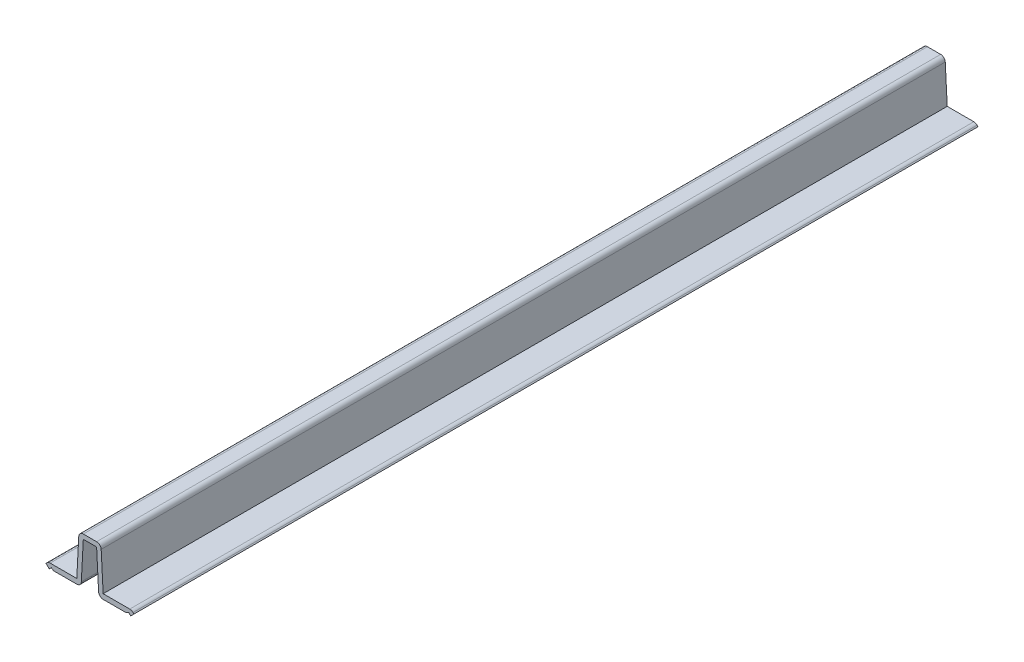
ISO-10303-21;
HEADER;
FILE_DESCRIPTION(('STEP AP214'),'2;1');
FILE_NAME('part.step','',(''),(''),'','','');
FILE_SCHEMA(('AUTOMOTIVE_DESIGN { 1 0 10303 214 1 1 1 1 }'));
ENDSEC;
DATA;
#1=APPLICATION_CONTEXT('core data for automotive mechanical design processes');
#2=APPLICATION_PROTOCOL_DEFINITION('international standard','automotive_design',2000,#1);
#3=PRODUCT_CONTEXT('',#1,'mechanical');
#4=PRODUCT('Part','Part','',(#3));
#5=PRODUCT_RELATED_PRODUCT_CATEGORY('part','',(#4));
#6=PRODUCT_DEFINITION_FORMATION('','',#4);
#7=PRODUCT_DEFINITION_CONTEXT('part definition',#1,'design');
#8=PRODUCT_DEFINITION('design','',#6,#7);
#9=PRODUCT_DEFINITION_SHAPE('','',#8);
#10=(LENGTH_UNIT() NAMED_UNIT(*) SI_UNIT(.MILLI.,.METRE.));
#11=(NAMED_UNIT(*) PLANE_ANGLE_UNIT() SI_UNIT($,.RADIAN.));
#12=(NAMED_UNIT(*) SI_UNIT($,.STERADIAN.) SOLID_ANGLE_UNIT());
#13=UNCERTAINTY_MEASURE_WITH_UNIT(LENGTH_MEASURE(1.E-05),#10,'distance_accuracy_value','');
#14=(GEOMETRIC_REPRESENTATION_CONTEXT(3) GLOBAL_UNCERTAINTY_ASSIGNED_CONTEXT((#13)) GLOBAL_UNIT_ASSIGNED_CONTEXT((#10,
#11,#12)) REPRESENTATION_CONTEXT('',''));
#15=CARTESIAN_POINT('',(0.,0.,0.));
#16=DIRECTION('',(0.,0.,1.));
#17=DIRECTION('',(1.,0.,0.));
#18=AXIS2_PLACEMENT_3D('',#15,#16,#17);
#19=CARTESIAN_POINT('',(-15.0600887340313,1.984375,-304.8));
#20=DIRECTION('',(-0.710174584155781,0.704025610343235,0.));
#21=DIRECTION('',(-0.704025610343235,-0.710174584155781,0.));
#22=AXIS2_PLACEMENT_3D('',#19,#20,#21);
#23=PLANE('',#22);
#24=DIRECTION('',(-0.704025610343235,-0.710174584155781,0.));
#25=VECTOR('',#24,1.);
#26=CARTESIAN_POINT('',(-15.0600887340313,1.984375,0.));
#27=LINE('',#26,#25);
#28=CARTESIAN_POINT('',(-15.5445114932518,1.49572128267668,0.));
#29=VERTEX_POINT('',#28);
#30=CARTESIAN_POINT('',(-15.875,1.16234628267668,0.));
#31=VERTEX_POINT('',#30);
#32=EDGE_CURVE('E265',#29,#31,#27,.T.);
#33=ORIENTED_EDGE('',*,*,#32,.F.);
#34=DIRECTION('',(0.,0.,1.));
#35=VECTOR('',#34,1.);
#36=CARTESIAN_POINT('',(-15.5445114932518,1.49572128267668,-304.8));
#37=LINE('',#36,#35);
#38=CARTESIAN_POINT('',(-15.5445114932518,1.49572128267668,-304.8));
#39=VERTEX_POINT('',#38);
#40=EDGE_CURVE('E204',#29,#39,#37,.F.);
#41=ORIENTED_EDGE('',*,*,#40,.T.);
#42=DIRECTION('',(-0.704025610343235,-0.710174584155781,0.));
#43=VECTOR('',#42,1.);
#44=CARTESIAN_POINT('',(-15.0600887340313,1.984375,-304.8));
#45=LINE('',#44,#43);
#46=CARTESIAN_POINT('',(-15.875,1.16234628267668,-304.8));
#47=VERTEX_POINT('',#46);
#48=EDGE_CURVE('E198',#39,#47,#45,.T.);
#49=ORIENTED_EDGE('',*,*,#48,.T.);
#50=DIRECTION('',(0.,0.,1.));
#51=VECTOR('',#50,1.);
#52=CARTESIAN_POINT('',(-15.875,1.16234628267668,-304.8));
#53=LINE('',#52,#51);
#54=EDGE_CURVE('E201',#47,#31,#53,.T.);
#55=ORIENTED_EDGE('',*,*,#54,.T.);
#56=EDGE_LOOP('',(#33,#41,#49,#55));
#57=FACE_BOUND('',#56,.T.);
#58=ADVANCED_FACE('F35',(#57),#23,.T.);
#59=CARTESIAN_POINT('',(-4.7625,1.984375,-304.8));
#60=DIRECTION('',(0.,1.,0.));
#61=DIRECTION('',(-1.,0.,0.));
#62=AXIS2_PLACEMENT_3D('',#59,#60,#61);
#63=PLANE('',#62);
#64=DIRECTION('',(-1.,0.,0.));
#65=VECTOR('',#64,1.);
#66=CARTESIAN_POINT('',(-4.7625,1.984375,-304.8));
#67=LINE('',#66,#65);
#68=CARTESIAN_POINT('',(-4.7625,1.984375,-304.8));
#69=VERTEX_POINT('',#68);
#70=CARTESIAN_POINT('',(-14.3720132548106,1.984375,-304.8));
#71=VERTEX_POINT('',#70);
#72=EDGE_CURVE('E216',#69,#71,#67,.T.);
#73=ORIENTED_EDGE('',*,*,#72,.T.);
#74=DIRECTION('',(0.,0.,1.));
#75=VECTOR('',#74,1.);
#76=CARTESIAN_POINT('',(-14.3720132548106,1.984375,-304.8));
#77=LINE('',#76,#75);
#78=CARTESIAN_POINT('',(-14.3720132548106,1.984375,0.));
#79=VERTEX_POINT('',#78);
#80=EDGE_CURVE('E364',#71,#79,#77,.T.);
#81=ORIENTED_EDGE('',*,*,#80,.T.);
#82=DIRECTION('',(-1.,0.,0.));
#83=VECTOR('',#82,1.);
#84=CARTESIAN_POINT('',(-4.7625,1.984375,0.));
#85=LINE('',#84,#83);
#86=CARTESIAN_POINT('',(-4.7625,1.984375,0.));
#87=VERTEX_POINT('',#86);
#88=EDGE_CURVE('E208',#87,#79,#85,.T.);
#89=ORIENTED_EDGE('',*,*,#88,.F.);
#90=DIRECTION('',(0.,0.,1.));
#91=VECTOR('',#90,1.);
#92=CARTESIAN_POINT('',(-4.7625,1.984375,-304.8));
#93=LINE('',#92,#91);
#94=EDGE_CURVE('E311',#69,#87,#93,.T.);
#95=ORIENTED_EDGE('',*,*,#94,.F.);
#96=EDGE_LOOP('',(#73,#81,#89,#95));
#97=FACE_BOUND('',#96,.T.);
#98=ADVANCED_FACE('F466',(#97),#63,.T.);
#99=CARTESIAN_POINT('',(-4.7625,1.984375,-304.8));
#100=DIRECTION('',(-0.99861782933251,0.0525588331227637,0.));
#101=DIRECTION('',(-0.0525588331227637,-0.99861782933251,0.));
#102=AXIS2_PLACEMENT_3D('',#99,#100,#101);
#103=PLANE('',#102);
#104=DIRECTION('',(-0.0525588331227637,-0.99861782933251,0.));
#105=VECTOR('',#104,1.);
#106=CARTESIAN_POINT('',(-4.7625,1.984375,0.));
#107=LINE('',#106,#105);
#108=CARTESIAN_POINT('',(-4.05107765086917,15.5013996334857,0.));
#109=VERTEX_POINT('',#108);
#110=EDGE_CURVE('E307',#109,#87,#107,.T.);
#111=ORIENTED_EDGE('',*,*,#110,.F.);
#112=DIRECTION('',(0.,0.,1.));
#113=VECTOR('',#112,1.);
#114=CARTESIAN_POINT('',(-4.05107765086917,15.5013996334857,-304.8));
#115=LINE('',#114,#113);
#116=CARTESIAN_POINT('',(-4.05107765086917,15.5013996334857,-304.8));
#117=VERTEX_POINT('',#116);
#118=EDGE_CURVE('E43',#109,#117,#115,.F.);
#119=ORIENTED_EDGE('',*,*,#118,.T.);
#120=DIRECTION('',(-0.0525588331227637,-0.99861782933251,0.));
#121=VECTOR('',#120,1.);
#122=CARTESIAN_POINT('',(-4.7625,1.984375,-304.8));
#123=LINE('',#122,#121);
#124=EDGE_CURVE('E261',#117,#69,#123,.T.);
#125=ORIENTED_EDGE('',*,*,#124,.T.);
#126=ORIENTED_EDGE('',*,*,#94,.T.);
#127=EDGE_LOOP('',(#111,#119,#125,#126));
#128=FACE_BOUND('',#127,.T.);
#129=ADVANCED_FACE('F385',(#128),#103,.T.);
#130=CARTESIAN_POINT('',(-3.96875,17.065625,-304.8));
#131=DIRECTION('',(0.,1.,0.));
#132=DIRECTION('',(0.,0.,1.));
#133=AXIS2_PLACEMENT_3D('',#130,#131,#132);
#134=PLANE('',#133);
#135=DIRECTION('',(-1.,0.,0.));
#136=VECTOR('',#135,1.);
#137=CARTESIAN_POINT('',(3.96875,17.065625,-304.8));
#138=LINE('',#137,#136);
#139=CARTESIAN_POINT('',(2.4023596146412,17.065625,-304.8));
#140=VERTEX_POINT('',#139);
#141=CARTESIAN_POINT('',(-2.4023596146412,17.065625,-304.8));
#142=VERTEX_POINT('',#141);
#143=EDGE_CURVE('E258',#140,#142,#138,.T.);
#144=ORIENTED_EDGE('',*,*,#143,.T.);
#145=DIRECTION('',(0.,0.,1.));
#146=VECTOR('',#145,1.);
#147=CARTESIAN_POINT('',(-2.4023596146412,17.065625,-304.8));
#148=LINE('',#147,#146);
#149=CARTESIAN_POINT('',(-2.4023596146412,17.065625,0.));
#150=VERTEX_POINT('',#149);
#151=EDGE_CURVE('E379',#142,#150,#148,.T.);
#152=ORIENTED_EDGE('',*,*,#151,.T.);
#153=DIRECTION('',(-1.,0.,0.));
#154=VECTOR('',#153,1.);
#155=CARTESIAN_POINT('',(-3.96875,17.065625,0.));
#156=LINE('',#155,#154);
#157=CARTESIAN_POINT('',(2.4023596146412,17.065625,0.));
#158=VERTEX_POINT('',#157);
#159=EDGE_CURVE('E304',#158,#150,#156,.T.);
#160=ORIENTED_EDGE('',*,*,#159,.F.);
#161=DIRECTION('',(0.,0.,1.));
#162=VECTOR('',#161,1.);
#163=CARTESIAN_POINT('',(2.4023596146412,17.065625,-304.8));
#164=LINE('',#163,#162);
#165=EDGE_CURVE('E377',#158,#140,#164,.F.);
#166=ORIENTED_EDGE('',*,*,#165,.T.);
#167=EDGE_LOOP('',(#144,#152,#160,#166));
#168=FACE_BOUND('',#167,.T.);
#169=ADVANCED_FACE('F395',(#168),#134,.T.);
#170=CARTESIAN_POINT('',(4.7625,1.984375,-304.8));
#171=DIRECTION('',(0.99861782933251,0.0525588331227637,0.));
#172=DIRECTION('',(-0.0525588331227637,0.99861782933251,0.));
#173=AXIS2_PLACEMENT_3D('',#170,#171,#172);
#174=PLANE('',#173);
#175=DIRECTION('',(-0.0525588331227637,0.99861782933251,0.));
#176=VECTOR('',#175,1.);
#177=CARTESIAN_POINT('',(4.7625,1.984375,-304.8));
#178=LINE('',#177,#176);
#179=CARTESIAN_POINT('',(4.7625,1.984375,-304.8));
#180=VERTEX_POINT('',#179);
#181=CARTESIAN_POINT('',(4.05107765086917,15.5013996334857,-304.8));
#182=VERTEX_POINT('',#181);
#183=EDGE_CURVE('E255',#180,#182,#178,.T.);
#184=ORIENTED_EDGE('',*,*,#183,.T.);
#185=DIRECTION('',(0.,0.,1.));
#186=VECTOR('',#185,1.);
#187=CARTESIAN_POINT('',(4.05107765086917,15.5013996334857,-304.8));
#188=LINE('',#187,#186);
#189=CARTESIAN_POINT('',(4.05107765086917,15.5013996334857,0.));
#190=VERTEX_POINT('',#189);
#191=EDGE_CURVE('E11',#182,#190,#188,.T.);
#192=ORIENTED_EDGE('',*,*,#191,.T.);
#193=DIRECTION('',(-0.0525588331227637,0.99861782933251,0.));
#194=VECTOR('',#193,1.);
#195=CARTESIAN_POINT('',(4.7625,1.984375,0.));
#196=LINE('',#195,#194);
#197=CARTESIAN_POINT('',(4.7625,1.984375,0.));
#198=VERTEX_POINT('',#197);
#199=EDGE_CURVE('E301',#198,#190,#196,.T.);
#200=ORIENTED_EDGE('',*,*,#199,.F.);
#201=DIRECTION('',(0.,0.,1.));
#202=VECTOR('',#201,1.);
#203=CARTESIAN_POINT('',(4.7625,1.984375,-304.8));
#204=LINE('',#203,#202);
#205=EDGE_CURVE('E315',#180,#198,#204,.T.);
#206=ORIENTED_EDGE('',*,*,#205,.F.);
#207=EDGE_LOOP('',(#184,#192,#200,#206));
#208=FACE_BOUND('',#207,.T.);
#209=ADVANCED_FACE('F404',(#208),#174,.T.);
#210=CARTESIAN_POINT('',(4.7625,1.984375,-304.8));
#211=DIRECTION('',(0.,1.,0.));
#212=DIRECTION('',(-1.,0.,0.));
#213=AXIS2_PLACEMENT_3D('',#210,#211,#212);
#214=PLANE('',#213);
#215=DIRECTION('',(-1.,0.,0.));
#216=VECTOR('',#215,1.);
#217=CARTESIAN_POINT('',(4.7625,1.984375,0.));
#218=LINE('',#217,#216);
#219=CARTESIAN_POINT('',(14.3720132548106,1.984375,0.));
#220=VERTEX_POINT('',#219);
#221=EDGE_CURVE('E299',#220,#198,#218,.T.);
#222=ORIENTED_EDGE('',*,*,#221,.F.);
#223=DIRECTION('',(0.,0.,1.));
#224=VECTOR('',#223,1.);
#225=CARTESIAN_POINT('',(14.3720132548106,1.984375,-304.8));
#226=LINE('',#225,#224);
#227=CARTESIAN_POINT('',(14.3720132548106,1.984375,-304.8));
#228=VERTEX_POINT('',#227);
#229=EDGE_CURVE('E351',#220,#228,#226,.F.);
#230=ORIENTED_EDGE('',*,*,#229,.T.);
#231=DIRECTION('',(-1.,0.,0.));
#232=VECTOR('',#231,1.);
#233=CARTESIAN_POINT('',(4.7625,1.984375,-304.8));
#234=LINE('',#233,#232);
#235=EDGE_CURVE('E253',#228,#180,#234,.T.);
#236=ORIENTED_EDGE('',*,*,#235,.T.);
#237=ORIENTED_EDGE('',*,*,#205,.T.);
#238=EDGE_LOOP('',(#222,#230,#236,#237));
#239=FACE_BOUND('',#238,.T.);
#240=ADVANCED_FACE('F483',(#239),#214,.T.);
#241=CARTESIAN_POINT('',(15.0600887340313,1.984375,-304.8));
#242=DIRECTION('',(0.710174584155781,0.704025610343235,0.));
#243=DIRECTION('',(-0.704025610343235,0.710174584155781,0.));
#244=AXIS2_PLACEMENT_3D('',#241,#242,#243);
#245=PLANE('',#244);
#246=DIRECTION('',(-0.704025610343235,0.710174584155781,0.));
#247=VECTOR('',#246,1.);
#248=CARTESIAN_POINT('',(15.0600887340313,1.984375,-304.8));
#249=LINE('',#248,#247);
#250=CARTESIAN_POINT('',(15.875,1.16234628267668,-304.8));
#251=VERTEX_POINT('',#250);
#252=CARTESIAN_POINT('',(15.5445114932518,1.49572128267668,-304.8));
#253=VERTEX_POINT('',#252);
#254=EDGE_CURVE('E250',#251,#253,#249,.T.);
#255=ORIENTED_EDGE('',*,*,#254,.T.);
#256=DIRECTION('',(0.,0.,1.));
#257=VECTOR('',#256,1.);
#258=CARTESIAN_POINT('',(15.5445114932518,1.49572128267668,-304.8));
#259=LINE('',#258,#257);
#260=CARTESIAN_POINT('',(15.5445114932518,1.49572128267668,0.));
#261=VERTEX_POINT('',#260);
#262=EDGE_CURVE('E314',#253,#261,#259,.T.);
#263=ORIENTED_EDGE('',*,*,#262,.T.);
#264=DIRECTION('',(-0.704025610343235,0.710174584155781,0.));
#265=VECTOR('',#264,1.);
#266=CARTESIAN_POINT('',(15.0600887340313,1.984375,0.));
#267=LINE('',#266,#265);
#268=CARTESIAN_POINT('',(15.875,1.16234628267668,0.));
#269=VERTEX_POINT('',#268);
#270=EDGE_CURVE('E296',#269,#261,#267,.T.);
#271=ORIENTED_EDGE('',*,*,#270,.F.);
#272=DIRECTION('',(0.,0.,1.));
#273=VECTOR('',#272,1.);
#274=CARTESIAN_POINT('',(15.875,1.16234628267668,-304.8));
#275=LINE('',#274,#273);
#276=EDGE_CURVE('E318',#251,#269,#275,.T.);
#277=ORIENTED_EDGE('',*,*,#276,.F.);
#278=EDGE_LOOP('',(#255,#263,#271,#277));
#279=FACE_BOUND('',#278,.T.);
#280=ADVANCED_FACE('F416',(#279),#245,.T.);
#281=CARTESIAN_POINT('',(15.875,1.16234628267668,-304.8));
#282=DIRECTION('',(0.704025610343234,-0.710174584155781,0.));
#283=DIRECTION('',(0.710174584155781,0.704025610343234,0.));
#284=AXIS2_PLACEMENT_3D('',#281,#282,#283);
#285=PLANE('',#284);
#286=DIRECTION('',(0.710174584155781,0.704025610343234,0.));
#287=VECTOR('',#286,1.);
#288=CARTESIAN_POINT('',(15.875,1.16234628267668,0.));
#289=LINE('',#288,#287);
#290=CARTESIAN_POINT('',(14.7025017615588,0.,0.));
#291=VERTEX_POINT('',#290);
#292=EDGE_CURVE('E293',#291,#269,#289,.T.);
#293=ORIENTED_EDGE('',*,*,#292,.F.);
#294=DIRECTION('',(0.,0.,1.));
#295=VECTOR('',#294,1.);
#296=CARTESIAN_POINT('',(14.7025017615588,0.,-304.8));
#297=LINE('',#296,#295);
#298=CARTESIAN_POINT('',(14.7025017615588,0.,-304.8));
#299=VERTEX_POINT('',#298);
#300=EDGE_CURVE('E320',#299,#291,#297,.T.);
#301=ORIENTED_EDGE('',*,*,#300,.F.);
#302=DIRECTION('',(0.710174584155781,0.704025610343234,0.));
#303=VECTOR('',#302,1.);
#304=CARTESIAN_POINT('',(15.875,1.16234628267668,-304.8));
#305=LINE('',#304,#303);
#306=EDGE_CURVE('E247',#299,#251,#305,.T.);
#307=ORIENTED_EDGE('',*,*,#306,.T.);
#308=ORIENTED_EDGE('',*,*,#276,.T.);
#309=EDGE_LOOP('',(#293,#301,#307,#308));
#310=FACE_BOUND('',#309,.T.);
#311=ADVANCED_FACE('F421',(#310),#285,.T.);
#312=CARTESIAN_POINT('',(14.7025017615588,0.,-304.8));
#313=DIRECTION('',(-0.710174584155781,-0.704025610343234,0.));
#314=DIRECTION('',(0.704025610343234,-0.710174584155781,0.));
#315=AXIS2_PLACEMENT_3D('',#312,#313,#314);
#316=PLANE('',#315);
#317=DIRECTION('',(0.704025610343234,-0.710174584155781,0.));
#318=VECTOR('',#317,1.);
#319=CARTESIAN_POINT('',(14.7025017615588,0.,0.));
#320=LINE('',#319,#318);
#321=CARTESIAN_POINT('',(13.9544315539956,0.754603867771928,0.));
#322=VERTEX_POINT('',#321);
#323=EDGE_CURVE('E290',#322,#291,#320,.T.);
#324=ORIENTED_EDGE('',*,*,#323,.F.);
#325=DIRECTION('',(0.,0.,1.));
#326=VECTOR('',#325,1.);
#327=CARTESIAN_POINT('',(13.9544315539956,0.754603867771928,-304.8));
#328=LINE('',#327,#326);
#329=CARTESIAN_POINT('',(13.9544315539956,0.754603867771928,-304.8));
#330=VERTEX_POINT('',#329);
#331=EDGE_CURVE('E322',#330,#322,#328,.T.);
#332=ORIENTED_EDGE('',*,*,#331,.F.);
#333=DIRECTION('',(0.704025610343234,-0.710174584155781,0.));
#334=VECTOR('',#333,1.);
#335=CARTESIAN_POINT('',(14.7025017615588,0.,-304.8));
#336=LINE('',#335,#334);
#337=EDGE_CURVE('E244',#330,#299,#336,.T.);
#338=ORIENTED_EDGE('',*,*,#337,.T.);
#339=ORIENTED_EDGE('',*,*,#300,.T.);
#340=EDGE_LOOP('',(#324,#332,#338,#339));
#341=FACE_BOUND('',#340,.T.);
#342=ADVANCED_FACE('F426',(#341),#316,.T.);
#343=CARTESIAN_POINT('',(13.9544315539956,0.754603867771928,-304.8));
#344=DIRECTION('',(0.55614788543739,-0.831083346917456,0.));
#345=DIRECTION('',(0.831083346917456,0.55614788543739,0.));
#346=AXIS2_PLACEMENT_3D('',#343,#344,#345);
#347=PLANE('',#346);
#348=DIRECTION('',(0.831083346917456,0.55614788543739,0.));
#349=VECTOR('',#348,1.);
#350=CARTESIAN_POINT('',(13.9544315539956,0.754603867771928,0.));
#351=LINE('',#350,#349);
#352=CARTESIAN_POINT('',(13.1213739059299,0.197134811103178,0.));
#353=VERTEX_POINT('',#352);
#354=EDGE_CURVE('E287',#353,#322,#351,.T.);
#355=ORIENTED_EDGE('',*,*,#354,.F.);
#356=DIRECTION('',(0.,0.,1.));
#357=VECTOR('',#356,1.);
#358=CARTESIAN_POINT('',(13.1213739059299,0.197134811103178,-304.8));
#359=LINE('',#358,#357);
#360=CARTESIAN_POINT('',(13.1213739059299,0.197134811103178,-304.8));
#361=VERTEX_POINT('',#360);
#362=EDGE_CURVE('E324',#361,#353,#359,.T.);
#363=ORIENTED_EDGE('',*,*,#362,.F.);
#364=DIRECTION('',(0.831083346917456,0.55614788543739,0.));
#365=VECTOR('',#364,1.);
#366=CARTESIAN_POINT('',(13.9544315539956,0.754603867771928,-304.8));
#367=LINE('',#366,#365);
#368=EDGE_CURVE('E241',#361,#330,#367,.T.);
#369=ORIENTED_EDGE('',*,*,#368,.T.);
#370=ORIENTED_EDGE('',*,*,#331,.T.);
#371=EDGE_LOOP('',(#355,#363,#369,#370));
#372=FACE_BOUND('',#371,.T.);
#373=ADVANCED_FACE('F429',(#372),#347,.T.);
#374=CARTESIAN_POINT('',(13.1213739059299,0.197134811103178,-304.8));
#375=DIRECTION('',(0.,-1.,0.));
#376=DIRECTION('',(0.,0.,-1.));
#377=AXIS2_PLACEMENT_3D('',#374,#375,#376);
#378=PLANE('',#377);
#379=DIRECTION('',(1.,0.,0.));
#380=VECTOR('',#379,1.);
#381=CARTESIAN_POINT('',(13.1213739059299,0.197134811103178,0.));
#382=LINE('',#381,#380);
#383=CARTESIAN_POINT('',(4.76967053625773,0.197134811103178,0.));
#384=VERTEX_POINT('',#383);
#385=EDGE_CURVE('E285',#384,#353,#382,.T.);
#386=ORIENTED_EDGE('',*,*,#385,.F.);
#387=DIRECTION('',(0.,0.,1.));
#388=VECTOR('',#387,1.);
#389=CARTESIAN_POINT('',(4.76967053625773,0.197134811103178,-304.8));
#390=LINE('',#389,#388);
#391=CARTESIAN_POINT('',(4.76967053625773,0.197134811103178,-304.8));
#392=VERTEX_POINT('',#391);
#393=EDGE_CURVE('E375',#384,#392,#390,.F.);
#394=ORIENTED_EDGE('',*,*,#393,.T.);
#395=DIRECTION('',(1.,0.,0.));
#396=VECTOR('',#395,1.);
#397=CARTESIAN_POINT('',(13.1213739059299,0.197134811103178,-304.8));
#398=LINE('',#397,#396);
#399=EDGE_CURVE('E239',#392,#361,#398,.T.);
#400=ORIENTED_EDGE('',*,*,#399,.T.);
#401=ORIENTED_EDGE('',*,*,#362,.T.);
#402=EDGE_LOOP('',(#386,#394,#400,#401));
#403=FACE_BOUND('',#402,.T.);
#404=ADVANCED_FACE('F494',(#403),#378,.T.);
#405=CARTESIAN_POINT('',(2.4023596146412,15.414625,-304.8));
#406=DIRECTION('',(-0.99861782933251,-0.0525588331227635,0.));
#407=DIRECTION('',(0.0525588331227636,-0.99861782933251,0.));
#408=AXIS2_PLACEMENT_3D('',#405,#406,#407);
#409=PLANE('',#408);
#410=DIRECTION('',(0.0525588331227636,-0.99861782933251,0.));
#411=VECTOR('',#410,1.);
#412=CARTESIAN_POINT('',(2.4023596146412,15.414625,-304.8));
#413=LINE('',#412,#411);
#414=CARTESIAN_POINT('',(2.4023596146412,15.414625,-304.8));
#415=VERTEX_POINT('',#414);
#416=CARTESIAN_POINT('',(3.12095250002975,1.7613601776175,-304.8));
#417=VERTEX_POINT('',#416);
#418=EDGE_CURVE('E236',#415,#417,#413,.T.);
#419=ORIENTED_EDGE('',*,*,#418,.T.);
#420=DIRECTION('',(0.,0.,1.));
#421=VECTOR('',#420,1.);
#422=CARTESIAN_POINT('',(3.12095250002975,1.76136017761749,-304.8));
#423=LINE('',#422,#421);
#424=CARTESIAN_POINT('',(3.12095250002975,1.7613601776175,0.));
#425=VERTEX_POINT('',#424);
#426=EDGE_CURVE('E372',#417,#425,#423,.T.);
#427=ORIENTED_EDGE('',*,*,#426,.T.);
#428=DIRECTION('',(0.0525588331227636,-0.99861782933251,0.));
#429=VECTOR('',#428,1.);
#430=CARTESIAN_POINT('',(2.4023596146412,15.414625,0.));
#431=LINE('',#430,#429);
#432=CARTESIAN_POINT('',(2.4023596146412,15.414625,0.));
#433=VERTEX_POINT('',#432);
#434=EDGE_CURVE('E282',#433,#425,#431,.T.);
#435=ORIENTED_EDGE('',*,*,#434,.F.);
#436=DIRECTION('',(0.,0.,1.));
#437=VECTOR('',#436,1.);
#438=CARTESIAN_POINT('',(2.4023596146412,15.414625,-304.8));
#439=LINE('',#438,#437);
#440=EDGE_CURVE('E327',#415,#433,#439,.T.);
#441=ORIENTED_EDGE('',*,*,#440,.F.);
#442=EDGE_LOOP('',(#419,#427,#435,#441));
#443=FACE_BOUND('',#442,.T.);
#444=ADVANCED_FACE('F441',(#443),#409,.T.);
#445=CARTESIAN_POINT('',(2.4023596146412,15.414625,-304.8));
#446=DIRECTION('',(0.,-1.,0.));
#447=DIRECTION('',(0.,0.,-1.));
#448=AXIS2_PLACEMENT_3D('',#445,#446,#447);
#449=PLANE('',#448);
#450=DIRECTION('',(1.,0.,0.));
#451=VECTOR('',#450,1.);
#452=CARTESIAN_POINT('',(2.4023596146412,15.414625,0.));
#453=LINE('',#452,#451);
#454=CARTESIAN_POINT('',(-2.4023596146412,15.414625,0.));
#455=VERTEX_POINT('',#454);
#456=EDGE_CURVE('E279',#455,#433,#453,.T.);
#457=ORIENTED_EDGE('',*,*,#456,.F.);
#458=DIRECTION('',(0.,0.,1.));
#459=VECTOR('',#458,1.);
#460=CARTESIAN_POINT('',(-2.4023596146412,15.414625,-304.8));
#461=LINE('',#460,#459);
#462=CARTESIAN_POINT('',(-2.4023596146412,15.414625,-304.8));
#463=VERTEX_POINT('',#462);
#464=EDGE_CURVE('E329',#463,#455,#461,.T.);
#465=ORIENTED_EDGE('',*,*,#464,.F.);
#466=DIRECTION('',(1.,0.,0.));
#467=VECTOR('',#466,1.);
#468=CARTESIAN_POINT('',(-2.4023596146412,15.414625,-304.8));
#469=LINE('',#468,#467);
#470=EDGE_CURVE('E234',#463,#415,#469,.T.);
#471=ORIENTED_EDGE('',*,*,#470,.T.);
#472=ORIENTED_EDGE('',*,*,#440,.T.);
#473=EDGE_LOOP('',(#457,#465,#471,#472));
#474=FACE_BOUND('',#473,.T.);
#475=ADVANCED_FACE('F447',(#474),#449,.T.);
#476=CARTESIAN_POINT('',(-2.4023596146412,15.414625,-304.8));
#477=DIRECTION('',(0.99861782933251,-0.0525588331227635,0.));
#478=DIRECTION('',(0.0525588331227636,0.99861782933251,0.));
#479=AXIS2_PLACEMENT_3D('',#476,#477,#478);
#480=PLANE('',#479);
#481=DIRECTION('',(0.0525588331227636,0.99861782933251,0.));
#482=VECTOR('',#481,1.);
#483=CARTESIAN_POINT('',(-2.4023596146412,15.414625,0.));
#484=LINE('',#483,#482);
#485=CARTESIAN_POINT('',(-3.12095250002975,1.7613601776175,0.));
#486=VERTEX_POINT('',#485);
#487=EDGE_CURVE('E277',#486,#455,#484,.T.);
#488=ORIENTED_EDGE('',*,*,#487,.F.);
#489=DIRECTION('',(0.,0.,1.));
#490=VECTOR('',#489,1.);
#491=CARTESIAN_POINT('',(-3.12095250002975,1.76136017761749,-304.8));
#492=LINE('',#491,#490);
#493=CARTESIAN_POINT('',(-3.12095250002975,1.7613601776175,-304.8));
#494=VERTEX_POINT('',#493);
#495=EDGE_CURVE('E58',#486,#494,#492,.F.);
#496=ORIENTED_EDGE('',*,*,#495,.T.);
#497=DIRECTION('',(0.0525588331227636,0.99861782933251,0.));
#498=VECTOR('',#497,1.);
#499=CARTESIAN_POINT('',(-2.4023596146412,15.414625,-304.8));
#500=LINE('',#499,#498);
#501=EDGE_CURVE('E232',#494,#463,#500,.T.);
#502=ORIENTED_EDGE('',*,*,#501,.T.);
#503=ORIENTED_EDGE('',*,*,#464,.T.);
#504=EDGE_LOOP('',(#488,#496,#502,#503));
#505=FACE_BOUND('',#504,.T.);
#506=ADVANCED_FACE('F449',(#505),#480,.T.);
#507=CARTESIAN_POINT('',(-13.1213739059299,0.197134811103178,-304.8));
#508=DIRECTION('',(0.,-1.,0.));
#509=DIRECTION('',(0.,0.,-1.));
#510=AXIS2_PLACEMENT_3D('',#507,#508,#509);
#511=PLANE('',#510);
#512=DIRECTION('',(1.,0.,0.));
#513=VECTOR('',#512,1.);
#514=CARTESIAN_POINT('',(-13.1213739059299,0.197134811103178,-304.8));
#515=LINE('',#514,#513);
#516=CARTESIAN_POINT('',(-13.1213739059299,0.197134811103178,-304.8));
#517=VERTEX_POINT('',#516);
#518=CARTESIAN_POINT('',(-4.76967053625773,0.197134811103178,-304.8));
#519=VERTEX_POINT('',#518);
#520=EDGE_CURVE('E230',#517,#519,#515,.T.);
#521=ORIENTED_EDGE('',*,*,#520,.T.);
#522=DIRECTION('',(0.,0.,1.));
#523=VECTOR('',#522,1.);
#524=CARTESIAN_POINT('',(-4.76967053625773,0.197134811103178,-304.8));
#525=LINE('',#524,#523);
#526=CARTESIAN_POINT('',(-4.76967053625773,0.197134811103178,0.));
#527=VERTEX_POINT('',#526);
#528=EDGE_CURVE('E368',#519,#527,#525,.T.);
#529=ORIENTED_EDGE('',*,*,#528,.T.);
#530=DIRECTION('',(1.,0.,0.));
#531=VECTOR('',#530,1.);
#532=CARTESIAN_POINT('',(-13.1213739059299,0.197134811103178,0.));
#533=LINE('',#532,#531);
#534=CARTESIAN_POINT('',(-13.1213739059299,0.197134811103178,0.));
#535=VERTEX_POINT('',#534);
#536=EDGE_CURVE('E274',#535,#527,#533,.T.);
#537=ORIENTED_EDGE('',*,*,#536,.F.);
#538=DIRECTION('',(0.,0.,1.));
#539=VECTOR('',#538,1.);
#540=CARTESIAN_POINT('',(-13.1213739059299,0.197134811103178,-304.8));
#541=LINE('',#540,#539);
#542=EDGE_CURVE('E332',#517,#535,#541,.T.);
#543=ORIENTED_EDGE('',*,*,#542,.F.);
#544=EDGE_LOOP('',(#521,#529,#537,#543));
#545=FACE_BOUND('',#544,.T.);
#546=ADVANCED_FACE('F455',(#545),#511,.T.);
#547=CARTESIAN_POINT('',(-13.9544315539956,0.754603867771928,-304.8));
#548=DIRECTION('',(-0.55614788543739,-0.831083346917456,0.));
#549=DIRECTION('',(0.831083346917456,-0.55614788543739,0.));
#550=AXIS2_PLACEMENT_3D('',#547,#548,#549);
#551=PLANE('',#550);
#552=DIRECTION('',(0.831083346917456,-0.55614788543739,0.));
#553=VECTOR('',#552,1.);
#554=CARTESIAN_POINT('',(-13.9544315539956,0.754603867771928,0.));
#555=LINE('',#554,#553);
#556=CARTESIAN_POINT('',(-13.9544315539956,0.754603867771928,0.));
#557=VERTEX_POINT('',#556);
#558=EDGE_CURVE('E271',#557,#535,#555,.T.);
#559=ORIENTED_EDGE('',*,*,#558,.F.);
#560=DIRECTION('',(0.,0.,1.));
#561=VECTOR('',#560,1.);
#562=CARTESIAN_POINT('',(-13.9544315539956,0.754603867771928,-304.8));
#563=LINE('',#562,#561);
#564=CARTESIAN_POINT('',(-13.9544315539956,0.754603867771928,-304.8));
#565=VERTEX_POINT('',#564);
#566=EDGE_CURVE('E334',#565,#557,#563,.T.);
#567=ORIENTED_EDGE('',*,*,#566,.F.);
#568=DIRECTION('',(0.831083346917456,-0.55614788543739,0.));
#569=VECTOR('',#568,1.);
#570=CARTESIAN_POINT('',(-13.9544315539956,0.754603867771928,-304.8));
#571=LINE('',#570,#569);
#572=EDGE_CURVE('E225',#565,#517,#571,.T.);
#573=ORIENTED_EDGE('',*,*,#572,.T.);
#574=ORIENTED_EDGE('',*,*,#542,.T.);
#575=EDGE_LOOP('',(#559,#567,#573,#574));
#576=FACE_BOUND('',#575,.T.);
#577=ADVANCED_FACE('F459',(#576),#551,.T.);
#578=CARTESIAN_POINT('',(-14.7025017615588,0.,-304.8));
#579=DIRECTION('',(0.710174584155781,-0.704025610343234,0.));
#580=DIRECTION('',(0.704025610343234,0.710174584155781,0.));
#581=AXIS2_PLACEMENT_3D('',#578,#579,#580);
#582=PLANE('',#581);
#583=DIRECTION('',(0.704025610343234,0.710174584155781,0.));
#584=VECTOR('',#583,1.);
#585=CARTESIAN_POINT('',(-14.7025017615588,0.,0.));
#586=LINE('',#585,#584);
#587=CARTESIAN_POINT('',(-14.7025017615588,0.,0.));
#588=VERTEX_POINT('',#587);
#589=EDGE_CURVE('E268',#588,#557,#586,.T.);
#590=ORIENTED_EDGE('',*,*,#589,.F.);
#591=DIRECTION('',(0.,0.,1.));
#592=VECTOR('',#591,1.);
#593=CARTESIAN_POINT('',(-14.7025017615588,0.,-304.8));
#594=LINE('',#593,#592);
#595=CARTESIAN_POINT('',(-14.7025017615588,0.,-304.8));
#596=VERTEX_POINT('',#595);
#597=EDGE_CURVE('E215',#596,#588,#594,.T.);
#598=ORIENTED_EDGE('',*,*,#597,.F.);
#599=DIRECTION('',(0.704025610343234,0.710174584155781,0.));
#600=VECTOR('',#599,1.);
#601=CARTESIAN_POINT('',(-14.7025017615588,0.,-304.8));
#602=LINE('',#601,#600);
#603=EDGE_CURVE('E223',#596,#565,#602,.T.);
#604=ORIENTED_EDGE('',*,*,#603,.T.);
#605=ORIENTED_EDGE('',*,*,#566,.T.);
#606=EDGE_LOOP('',(#590,#598,#604,#605));
#607=FACE_BOUND('',#606,.T.);
#608=ADVANCED_FACE('F461',(#607),#582,.T.);
#609=CARTESIAN_POINT('',(-15.875,1.16234628267668,-304.8));
#610=DIRECTION('',(-0.704025610343234,-0.710174584155781,0.));
#611=DIRECTION('',(0.710174584155781,-0.704025610343234,0.));
#612=AXIS2_PLACEMENT_3D('',#609,#610,#611);
#613=PLANE('',#612);
#614=DIRECTION('',(0.710174584155781,-0.704025610343234,0.));
#615=VECTOR('',#614,1.);
#616=CARTESIAN_POINT('',(-15.875,1.16234628267668,0.));
#617=LINE('',#616,#615);
#618=EDGE_CURVE('E214',#31,#588,#617,.T.);
#619=ORIENTED_EDGE('',*,*,#618,.F.);
#620=ORIENTED_EDGE('',*,*,#54,.F.);
#621=DIRECTION('',(0.710174584155781,-0.704025610343234,0.));
#622=VECTOR('',#621,1.);
#623=CARTESIAN_POINT('',(-15.875,1.16234628267668,-304.8));
#624=LINE('',#623,#622);
#625=EDGE_CURVE('E207',#47,#596,#624,.T.);
#626=ORIENTED_EDGE('',*,*,#625,.T.);
#627=ORIENTED_EDGE('',*,*,#597,.T.);
#628=EDGE_LOOP('',(#619,#620,#626,#627));
#629=FACE_BOUND('',#628,.T.);
#630=ADVANCED_FACE('F212',(#629),#613,.T.);
#631=CARTESIAN_POINT('',(0.,0.,-304.8));
#632=DIRECTION('',(0.,0.,1.));
#633=DIRECTION('',(1.,0.,0.));
#634=AXIS2_PLACEMENT_3D('',#631,#632,#633);
#635=PLANE('',#634);
#636=ORIENTED_EDGE('',*,*,#235,.F.);
#637=CARTESIAN_POINT('',(14.3720132548106,0.333375,-304.8));
#638=DIRECTION('',(0.,0.,1.));
#639=DIRECTION('',(1.,0.,0.));
#640=AXIS2_PLACEMENT_3D('',#637,#638,#639);
#641=CIRCLE('',#640,1.651);
#642=EDGE_CURVE('E362',#228,#253,#641,.F.);
#643=ORIENTED_EDGE('',*,*,#642,.T.);
#644=ORIENTED_EDGE('',*,*,#254,.F.);
#645=ORIENTED_EDGE('',*,*,#306,.F.);
#646=ORIENTED_EDGE('',*,*,#337,.F.);
#647=ORIENTED_EDGE('',*,*,#368,.F.);
#648=ORIENTED_EDGE('',*,*,#399,.F.);
#649=CARTESIAN_POINT('',(4.76967053625772,1.84813481110318,-304.8));
#650=DIRECTION('',(0.,0.,1.));
#651=DIRECTION('',(1.,0.,0.));
#652=AXIS2_PLACEMENT_3D('',#649,#650,#651);
#653=CIRCLE('',#652,1.651);
#654=EDGE_CURVE('E357',#392,#417,#653,.F.);
#655=ORIENTED_EDGE('',*,*,#654,.T.);
#656=ORIENTED_EDGE('',*,*,#418,.F.);
#657=ORIENTED_EDGE('',*,*,#470,.F.);
#658=ORIENTED_EDGE('',*,*,#501,.F.);
#659=CARTESIAN_POINT('',(-4.76967053625773,1.84813481110318,-304.8));
#660=DIRECTION('',(0.,0.,1.));
#661=DIRECTION('',(1.,0.,0.));
#662=AXIS2_PLACEMENT_3D('',#659,#660,#661);
#663=CIRCLE('',#662,1.651);
#664=EDGE_CURVE('E50',#494,#519,#663,.F.);
#665=ORIENTED_EDGE('',*,*,#664,.T.);
#666=ORIENTED_EDGE('',*,*,#520,.F.);
#667=ORIENTED_EDGE('',*,*,#572,.F.);
#668=ORIENTED_EDGE('',*,*,#603,.F.);
#669=ORIENTED_EDGE('',*,*,#625,.F.);
#670=ORIENTED_EDGE('',*,*,#48,.F.);
#671=CARTESIAN_POINT('',(-14.3720132548106,0.333375,-304.8));
#672=DIRECTION('',(0.,0.,1.));
#673=DIRECTION('',(1.,0.,0.));
#674=AXIS2_PLACEMENT_3D('',#671,#672,#673);
#675=CIRCLE('',#674,1.651);
#676=EDGE_CURVE('E360',#39,#71,#675,.F.);
#677=ORIENTED_EDGE('',*,*,#676,.T.);
#678=ORIENTED_EDGE('',*,*,#72,.F.);
#679=ORIENTED_EDGE('',*,*,#124,.F.);
#680=CARTESIAN_POINT('',(-2.4023596146412,15.414625,-304.8));
#681=DIRECTION('',(0.,0.,1.));
#682=DIRECTION('',(1.,0.,0.));
#683=AXIS2_PLACEMENT_3D('',#680,#681,#682);
#684=CIRCLE('',#683,1.651);
#685=EDGE_CURVE('E355',#117,#142,#684,.F.);
#686=ORIENTED_EDGE('',*,*,#685,.T.);
#687=ORIENTED_EDGE('',*,*,#143,.F.);
#688=CARTESIAN_POINT('',(2.4023596146412,15.414625,-304.8));
#689=DIRECTION('',(0.,0.,1.));
#690=DIRECTION('',(1.,0.,0.));
#691=AXIS2_PLACEMENT_3D('',#688,#689,#690);
#692=CIRCLE('',#691,1.651);
#693=EDGE_CURVE('E353',#140,#182,#692,.F.);
#694=ORIENTED_EDGE('',*,*,#693,.T.);
#695=ORIENTED_EDGE('',*,*,#183,.F.);
#696=EDGE_LOOP('',(#636,#643,#644,#645,#646,#647,#648,#655,#656,#657,#658,#665,#666,#667,#668,
#669,#670,#677,#678,#679,#686,#687,#694,#695));
#697=FACE_BOUND('',#696,.T.);
#698=ADVANCED_FACE('F220',(#697),#635,.F.);
#699=CARTESIAN_POINT('',(0.,0.,0.));
#700=DIRECTION('',(0.,0.,1.));
#701=DIRECTION('',(1.,0.,0.));
#702=AXIS2_PLACEMENT_3D('',#699,#700,#701);
#703=PLANE('',#702);
#704=ORIENTED_EDGE('',*,*,#270,.T.);
#705=CARTESIAN_POINT('',(14.3720132548106,0.333375,0.));
#706=DIRECTION('',(0.,0.,1.));
#707=DIRECTION('',(1.,0.,0.));
#708=AXIS2_PLACEMENT_3D('',#705,#706,#707);
#709=CIRCLE('',#708,1.651);
#710=EDGE_CURVE('E349',#261,#220,#709,.T.);
#711=ORIENTED_EDGE('',*,*,#710,.T.);
#712=ORIENTED_EDGE('',*,*,#221,.T.);
#713=ORIENTED_EDGE('',*,*,#199,.T.);
#714=CARTESIAN_POINT('',(2.4023596146412,15.414625,0.));
#715=DIRECTION('',(0.,0.,1.));
#716=DIRECTION('',(1.,0.,0.));
#717=AXIS2_PLACEMENT_3D('',#714,#715,#716);
#718=CIRCLE('',#717,1.651);
#719=EDGE_CURVE('E339',#190,#158,#718,.T.);
#720=ORIENTED_EDGE('',*,*,#719,.T.);
#721=ORIENTED_EDGE('',*,*,#159,.T.);
#722=CARTESIAN_POINT('',(-2.4023596146412,15.414625,0.));
#723=DIRECTION('',(0.,0.,1.));
#724=DIRECTION('',(1.,0.,0.));
#725=AXIS2_PLACEMENT_3D('',#722,#723,#724);
#726=CIRCLE('',#725,1.651);
#727=EDGE_CURVE('E341',#150,#109,#726,.T.);
#728=ORIENTED_EDGE('',*,*,#727,.T.);
#729=ORIENTED_EDGE('',*,*,#110,.T.);
#730=ORIENTED_EDGE('',*,*,#88,.T.);
#731=CARTESIAN_POINT('',(-14.3720132548106,0.333375,0.));
#732=DIRECTION('',(0.,0.,1.));
#733=DIRECTION('',(1.,0.,0.));
#734=AXIS2_PLACEMENT_3D('',#731,#732,#733);
#735=CIRCLE('',#734,1.651);
#736=EDGE_CURVE('E347',#79,#29,#735,.T.);
#737=ORIENTED_EDGE('',*,*,#736,.T.);
#738=ORIENTED_EDGE('',*,*,#32,.T.);
#739=ORIENTED_EDGE('',*,*,#618,.T.);
#740=ORIENTED_EDGE('',*,*,#589,.T.);
#741=ORIENTED_EDGE('',*,*,#558,.T.);
#742=ORIENTED_EDGE('',*,*,#536,.T.);
#743=CARTESIAN_POINT('',(-4.76967053625773,1.84813481110318,0.));
#744=DIRECTION('',(0.,0.,1.));
#745=DIRECTION('',(1.,0.,0.));
#746=AXIS2_PLACEMENT_3D('',#743,#744,#745);
#747=CIRCLE('',#746,1.651);
#748=EDGE_CURVE('E345',#527,#486,#747,.T.);
#749=ORIENTED_EDGE('',*,*,#748,.T.);
#750=ORIENTED_EDGE('',*,*,#487,.T.);
#751=ORIENTED_EDGE('',*,*,#456,.T.);
#752=ORIENTED_EDGE('',*,*,#434,.T.);
#753=CARTESIAN_POINT('',(4.76967053625772,1.84813481110318,0.));
#754=DIRECTION('',(0.,0.,1.));
#755=DIRECTION('',(1.,0.,0.));
#756=AXIS2_PLACEMENT_3D('',#753,#754,#755);
#757=CIRCLE('',#756,1.651);
#758=EDGE_CURVE('E343',#425,#384,#757,.T.);
#759=ORIENTED_EDGE('',*,*,#758,.T.);
#760=ORIENTED_EDGE('',*,*,#385,.T.);
#761=ORIENTED_EDGE('',*,*,#354,.T.);
#762=ORIENTED_EDGE('',*,*,#323,.T.);
#763=ORIENTED_EDGE('',*,*,#292,.T.);
#764=EDGE_LOOP('',(#704,#711,#712,#713,#720,#721,#728,#729,#730,#737,#738,#739,#740,#741,#742,
#749,#750,#751,#752,#759,#760,#761,#762,#763));
#765=FACE_BOUND('',#764,.T.);
#766=ADVANCED_FACE('F398',(#765),#703,.T.);
#767=CARTESIAN_POINT('',(14.3720132548106,0.333375,-304.8));
#768=DIRECTION('',(0.,0.,1.));
#769=DIRECTION('',(1.,0.,0.));
#770=AXIS2_PLACEMENT_3D('',#767,#768,#769);
#771=CYLINDRICAL_SURFACE('',#770,1.651);
#772=ORIENTED_EDGE('',*,*,#642,.F.);
#773=ORIENTED_EDGE('',*,*,#229,.F.);
#774=ORIENTED_EDGE('',*,*,#710,.F.);
#775=ORIENTED_EDGE('',*,*,#262,.F.);
#776=EDGE_LOOP('',(#772,#773,#774,#775));
#777=FACE_BOUND('',#776,.T.);
#778=ADVANCED_FACE('F413',(#777),#771,.T.);
#779=CARTESIAN_POINT('',(-14.3720132548106,0.333375,-304.8));
#780=DIRECTION('',(0.,0.,1.));
#781=DIRECTION('',(1.,0.,0.));
#782=AXIS2_PLACEMENT_3D('',#779,#780,#781);
#783=CYLINDRICAL_SURFACE('',#782,1.651);
#784=ORIENTED_EDGE('',*,*,#676,.F.);
#785=ORIENTED_EDGE('',*,*,#40,.F.);
#786=ORIENTED_EDGE('',*,*,#736,.F.);
#787=ORIENTED_EDGE('',*,*,#80,.F.);
#788=EDGE_LOOP('',(#784,#785,#786,#787));
#789=FACE_BOUND('',#788,.T.);
#790=ADVANCED_FACE('F463',(#789),#783,.T.);
#791=CARTESIAN_POINT('',(-4.76967053625773,1.84813481110318,-304.8));
#792=DIRECTION('',(0.,0.,1.));
#793=DIRECTION('',(1.,0.,0.));
#794=AXIS2_PLACEMENT_3D('',#791,#792,#793);
#795=CYLINDRICAL_SURFACE('',#794,1.651);
#796=ORIENTED_EDGE('',*,*,#664,.F.);
#797=ORIENTED_EDGE('',*,*,#495,.F.);
#798=ORIENTED_EDGE('',*,*,#748,.F.);
#799=ORIENTED_EDGE('',*,*,#528,.F.);
#800=EDGE_LOOP('',(#796,#797,#798,#799));
#801=FACE_BOUND('',#800,.T.);
#802=ADVANCED_FACE('F452',(#801),#795,.T.);
#803=CARTESIAN_POINT('',(4.76967053625772,1.84813481110318,-304.8));
#804=DIRECTION('',(0.,0.,1.));
#805=DIRECTION('',(1.,0.,0.));
#806=AXIS2_PLACEMENT_3D('',#803,#804,#805);
#807=CYLINDRICAL_SURFACE('',#806,1.651);
#808=ORIENTED_EDGE('',*,*,#654,.F.);
#809=ORIENTED_EDGE('',*,*,#393,.F.);
#810=ORIENTED_EDGE('',*,*,#758,.F.);
#811=ORIENTED_EDGE('',*,*,#426,.F.);
#812=EDGE_LOOP('',(#808,#809,#810,#811));
#813=FACE_BOUND('',#812,.T.);
#814=ADVANCED_FACE('F438',(#813),#807,.T.);
#815=CARTESIAN_POINT('',(-2.4023596146412,15.414625,-304.8));
#816=DIRECTION('',(0.,0.,1.));
#817=DIRECTION('',(1.,0.,0.));
#818=AXIS2_PLACEMENT_3D('',#815,#816,#817);
#819=CYLINDRICAL_SURFACE('',#818,1.651);
#820=ORIENTED_EDGE('',*,*,#685,.F.);
#821=ORIENTED_EDGE('',*,*,#118,.F.);
#822=ORIENTED_EDGE('',*,*,#727,.F.);
#823=ORIENTED_EDGE('',*,*,#151,.F.);
#824=EDGE_LOOP('',(#820,#821,#822,#823));
#825=FACE_BOUND('',#824,.T.);
#826=ADVANCED_FACE('F392',(#825),#819,.T.);
#827=CARTESIAN_POINT('',(2.4023596146412,15.414625,-304.8));
#828=DIRECTION('',(0.,0.,1.));
#829=DIRECTION('',(1.,0.,0.));
#830=AXIS2_PLACEMENT_3D('',#827,#828,#829);
#831=CYLINDRICAL_SURFACE('',#830,1.651);
#832=ORIENTED_EDGE('',*,*,#693,.F.);
#833=ORIENTED_EDGE('',*,*,#165,.F.);
#834=ORIENTED_EDGE('',*,*,#719,.F.);
#835=ORIENTED_EDGE('',*,*,#191,.F.);
#836=EDGE_LOOP('',(#832,#833,#834,#835));
#837=FACE_BOUND('',#836,.T.);
#838=ADVANCED_FACE('F37',(#837),#831,.T.);
#839=CLOSED_SHELL('',(#58,#98,#129,#169,#209,#240,#280,#311,#342,#373,#404,#444,#475,#506,#546,
#577,#608,#630,#698,#766,#778,#790,#802,#814,#826,#838));
#840=MANIFOLD_SOLID_BREP('B2',#839);
#841=ADVANCED_BREP_SHAPE_REPRESENTATION('',(#18,#840),#14);
#842=SHAPE_DEFINITION_REPRESENTATION(#9,#841);
ENDSEC;
END-ISO-10303-21;
